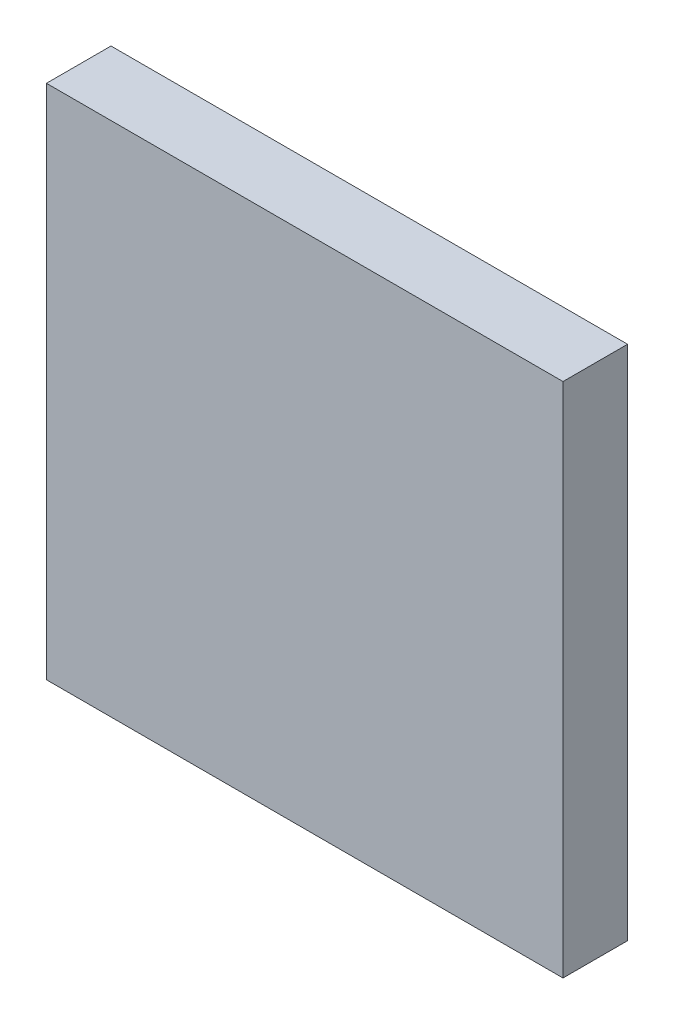
ISO-10303-21;
HEADER;
FILE_DESCRIPTION(('STEP AP214'),'2;1');
FILE_NAME('part.step','',(''),(''),'','','');
FILE_SCHEMA(('AUTOMOTIVE_DESIGN { 1 0 10303 214 1 1 1 1 }'));
ENDSEC;
DATA;
#1=APPLICATION_CONTEXT('core data for automotive mechanical design processes');
#2=APPLICATION_PROTOCOL_DEFINITION('international standard','automotive_design',2000,#1);
#3=PRODUCT_CONTEXT('',#1,'mechanical');
#4=PRODUCT('Part','Part','',(#3));
#5=PRODUCT_RELATED_PRODUCT_CATEGORY('part','',(#4));
#6=PRODUCT_DEFINITION_FORMATION('','',#4);
#7=PRODUCT_DEFINITION_CONTEXT('part definition',#1,'design');
#8=PRODUCT_DEFINITION('design','',#6,#7);
#9=PRODUCT_DEFINITION_SHAPE('','',#8);
#10=(LENGTH_UNIT() NAMED_UNIT(*) SI_UNIT(.MILLI.,.METRE.));
#11=(NAMED_UNIT(*) PLANE_ANGLE_UNIT() SI_UNIT($,.RADIAN.));
#12=(NAMED_UNIT(*) SI_UNIT($,.STERADIAN.) SOLID_ANGLE_UNIT());
#13=UNCERTAINTY_MEASURE_WITH_UNIT(LENGTH_MEASURE(1.E-05),#10,'distance_accuracy_value','');
#14=(GEOMETRIC_REPRESENTATION_CONTEXT(3) GLOBAL_UNCERTAINTY_ASSIGNED_CONTEXT((#13)) GLOBAL_UNIT_ASSIGNED_CONTEXT((#10,
#11,#12)) REPRESENTATION_CONTEXT('',''));
#15=CARTESIAN_POINT('',(0.,0.,0.));
#16=DIRECTION('',(0.,0.,1.));
#17=DIRECTION('',(1.,0.,0.));
#18=AXIS2_PLACEMENT_3D('',#15,#16,#17);
#19=CARTESIAN_POINT('',(-40.,40.,10.));
#20=DIRECTION('',(1.,0.,0.));
#21=DIRECTION('',(0.,1.,0.));
#22=AXIS2_PLACEMENT_3D('',#19,#20,#21);
#23=PLANE('',#22);
#24=DIRECTION('',(0.,-1.,0.));
#25=VECTOR('',#24,1.);
#26=CARTESIAN_POINT('',(-40.,40.,0.));
#27=LINE('',#26,#25);
#28=CARTESIAN_POINT('',(-40.,40.,0.));
#29=VERTEX_POINT('',#28);
#30=CARTESIAN_POINT('',(-40.,-40.,0.));
#31=VERTEX_POINT('',#30);
#32=EDGE_CURVE('E97',#29,#31,#27,.T.);
#33=ORIENTED_EDGE('',*,*,#32,.T.);
#34=DIRECTION('',(0.,0.,-1.));
#35=VECTOR('',#34,1.);
#36=CARTESIAN_POINT('',(-40.,-40.,10.));
#37=LINE('',#36,#35);
#38=CARTESIAN_POINT('',(-40.,-40.,10.));
#39=VERTEX_POINT('',#38);
#40=EDGE_CURVE('E11',#39,#31,#37,.T.);
#41=ORIENTED_EDGE('',*,*,#40,.F.);
#42=DIRECTION('',(0.,-1.,0.));
#43=VECTOR('',#42,1.);
#44=CARTESIAN_POINT('',(-40.,40.,10.));
#45=LINE('',#44,#43);
#46=CARTESIAN_POINT('',(-40.,40.,10.));
#47=VERTEX_POINT('',#46);
#48=EDGE_CURVE('E83',#47,#39,#45,.T.);
#49=ORIENTED_EDGE('',*,*,#48,.F.);
#50=DIRECTION('',(0.,0.,-1.));
#51=VECTOR('',#50,1.);
#52=CARTESIAN_POINT('',(-40.,40.,10.));
#53=LINE('',#52,#51);
#54=EDGE_CURVE('E50',#47,#29,#53,.T.);
#55=ORIENTED_EDGE('',*,*,#54,.T.);
#56=EDGE_LOOP('',(#33,#41,#49,#55));
#57=FACE_BOUND('',#56,.T.);
#58=ADVANCED_FACE('F34',(#57),#23,.F.);
#59=CARTESIAN_POINT('',(-40.,-40.,10.));
#60=DIRECTION('',(0.,1.,0.));
#61=DIRECTION('',(0.,0.,1.));
#62=AXIS2_PLACEMENT_3D('',#59,#60,#61);
#63=PLANE('',#62);
#64=DIRECTION('',(1.,0.,0.));
#65=VECTOR('',#64,1.);
#66=CARTESIAN_POINT('',(-40.,-40.,0.));
#67=LINE('',#66,#65);
#68=CARTESIAN_POINT('',(40.,-40.,0.));
#69=VERTEX_POINT('',#68);
#70=EDGE_CURVE('E88',#31,#69,#67,.T.);
#71=ORIENTED_EDGE('',*,*,#70,.T.);
#72=DIRECTION('',(0.,0.,-1.));
#73=VECTOR('',#72,1.);
#74=CARTESIAN_POINT('',(40.,-40.,10.));
#75=LINE('',#74,#73);
#76=CARTESIAN_POINT('',(40.,-40.,10.));
#77=VERTEX_POINT('',#76);
#78=EDGE_CURVE('E42',#77,#69,#75,.T.);
#79=ORIENTED_EDGE('',*,*,#78,.F.);
#80=DIRECTION('',(1.,0.,0.));
#81=VECTOR('',#80,1.);
#82=CARTESIAN_POINT('',(-40.,-40.,10.));
#83=LINE('',#82,#81);
#84=EDGE_CURVE('E75',#39,#77,#83,.T.);
#85=ORIENTED_EDGE('',*,*,#84,.F.);
#86=ORIENTED_EDGE('',*,*,#40,.T.);
#87=EDGE_LOOP('',(#71,#79,#85,#86));
#88=FACE_BOUND('',#87,.T.);
#89=ADVANCED_FACE('F87',(#88),#63,.F.);
#90=CARTESIAN_POINT('',(40.,40.,10.));
#91=DIRECTION('',(1.,0.,0.));
#92=DIRECTION('',(0.,0.,-1.));
#93=AXIS2_PLACEMENT_3D('',#90,#91,#92);
#94=PLANE('',#93);
#95=DIRECTION('',(0.,-1.,0.));
#96=VECTOR('',#95,1.);
#97=CARTESIAN_POINT('',(40.,40.,0.));
#98=LINE('',#97,#96);
#99=CARTESIAN_POINT('',(40.,40.,0.));
#100=VERTEX_POINT('',#99);
#101=EDGE_CURVE('E100',#100,#69,#98,.T.);
#102=ORIENTED_EDGE('',*,*,#101,.F.);
#103=DIRECTION('',(0.,0.,-1.));
#104=VECTOR('',#103,1.);
#105=CARTESIAN_POINT('',(40.,40.,10.));
#106=LINE('',#105,#104);
#107=CARTESIAN_POINT('',(40.,40.,10.));
#108=VERTEX_POINT('',#107);
#109=EDGE_CURVE('E64',#108,#100,#106,.T.);
#110=ORIENTED_EDGE('',*,*,#109,.F.);
#111=DIRECTION('',(0.,-1.,0.));
#112=VECTOR('',#111,1.);
#113=CARTESIAN_POINT('',(40.,40.,10.));
#114=LINE('',#113,#112);
#115=EDGE_CURVE('E82',#108,#77,#114,.T.);
#116=ORIENTED_EDGE('',*,*,#115,.T.);
#117=ORIENTED_EDGE('',*,*,#78,.T.);
#118=EDGE_LOOP('',(#102,#110,#116,#117));
#119=FACE_BOUND('',#118,.T.);
#120=ADVANCED_FACE('F91',(#119),#94,.T.);
#121=CARTESIAN_POINT('',(-40.,40.,10.));
#122=DIRECTION('',(0.,1.,0.));
#123=DIRECTION('',(0.,0.,1.));
#124=AXIS2_PLACEMENT_3D('',#121,#122,#123);
#125=PLANE('',#124);
#126=DIRECTION('',(1.,0.,0.));
#127=VECTOR('',#126,1.);
#128=CARTESIAN_POINT('',(-40.,40.,0.));
#129=LINE('',#128,#127);
#130=EDGE_CURVE('E102',#29,#100,#129,.T.);
#131=ORIENTED_EDGE('',*,*,#130,.F.);
#132=ORIENTED_EDGE('',*,*,#54,.F.);
#133=DIRECTION('',(1.,0.,0.));
#134=VECTOR('',#133,1.);
#135=CARTESIAN_POINT('',(-40.,40.,10.));
#136=LINE('',#135,#134);
#137=EDGE_CURVE('E92',#47,#108,#136,.T.);
#138=ORIENTED_EDGE('',*,*,#137,.T.);
#139=ORIENTED_EDGE('',*,*,#109,.T.);
#140=EDGE_LOOP('',(#131,#132,#138,#139));
#141=FACE_BOUND('',#140,.T.);
#142=ADVANCED_FACE('F108',(#141),#125,.T.);
#143=CARTESIAN_POINT('',(0.,0.,10.));
#144=DIRECTION('',(0.,0.,1.));
#145=DIRECTION('',(1.,0.,0.));
#146=AXIS2_PLACEMENT_3D('',#143,#144,#145);
#147=PLANE('',#146);
#148=ORIENTED_EDGE('',*,*,#48,.T.);
#149=ORIENTED_EDGE('',*,*,#84,.T.);
#150=ORIENTED_EDGE('',*,*,#115,.F.);
#151=ORIENTED_EDGE('',*,*,#137,.F.);
#152=EDGE_LOOP('',(#148,#149,#150,#151));
#153=FACE_BOUND('',#152,.T.);
#154=ADVANCED_FACE('F79',(#153),#147,.T.);
#155=CARTESIAN_POINT('',(0.,0.,0.));
#156=DIRECTION('',(0.,0.,1.));
#157=DIRECTION('',(1.,0.,0.));
#158=AXIS2_PLACEMENT_3D('',#155,#156,#157);
#159=PLANE('',#158);
#160=ORIENTED_EDGE('',*,*,#32,.F.);
#161=ORIENTED_EDGE('',*,*,#130,.T.);
#162=ORIENTED_EDGE('',*,*,#101,.T.);
#163=ORIENTED_EDGE('',*,*,#70,.F.);
#164=EDGE_LOOP('',(#160,#161,#162,#163));
#165=FACE_BOUND('',#164,.T.);
#166=ADVANCED_FACE('F107',(#165),#159,.F.);
#167=CLOSED_SHELL('',(#58,#89,#120,#142,#154,#166));
#168=MANIFOLD_SOLID_BREP('B2',#167);
#169=ADVANCED_BREP_SHAPE_REPRESENTATION('',(#18,#168),#14);
#170=SHAPE_DEFINITION_REPRESENTATION(#9,#169);
ENDSEC;
END-ISO-10303-21;
